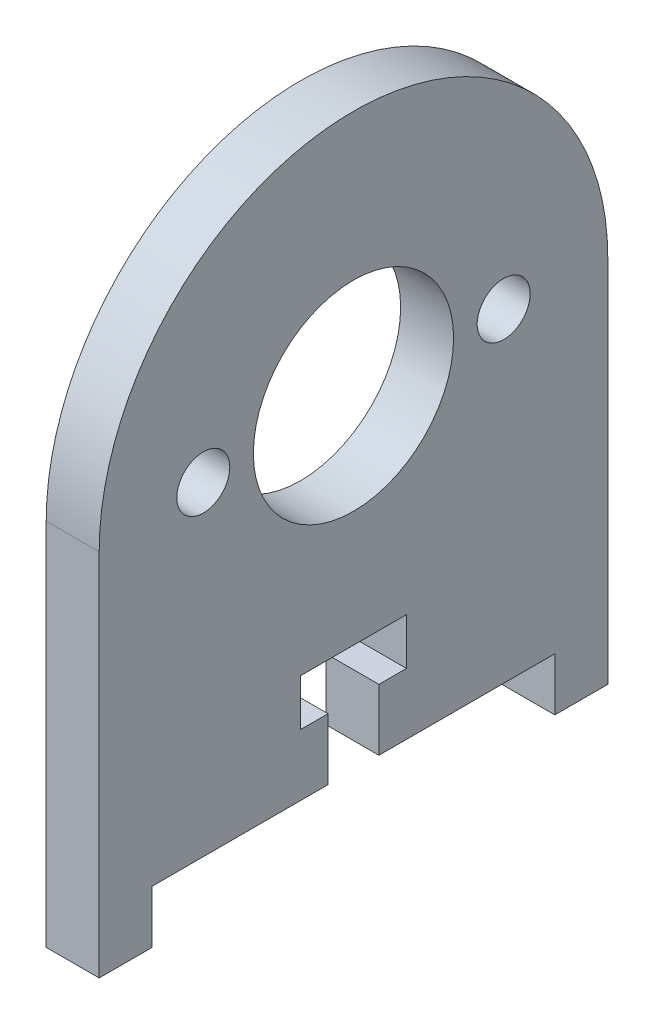
ISO-10303-21;
HEADER;
FILE_DESCRIPTION(('STEP AP214'),'2;1');
FILE_NAME('part.step','',(''),(''),'','','');
FILE_SCHEMA(('AUTOMOTIVE_DESIGN { 1 0 10303 214 1 1 1 1 }'));
ENDSEC;
DATA;
#1=APPLICATION_CONTEXT('core data for automotive mechanical design processes');
#2=APPLICATION_PROTOCOL_DEFINITION('international standard','automotive_design',2000,#1);
#3=PRODUCT_CONTEXT('',#1,'mechanical');
#4=PRODUCT('Part','Part','',(#3));
#5=PRODUCT_RELATED_PRODUCT_CATEGORY('part','',(#4));
#6=PRODUCT_DEFINITION_FORMATION('','',#4);
#7=PRODUCT_DEFINITION_CONTEXT('part definition',#1,'design');
#8=PRODUCT_DEFINITION('design','',#6,#7);
#9=PRODUCT_DEFINITION_SHAPE('','',#8);
#10=(LENGTH_UNIT() NAMED_UNIT(*) SI_UNIT(.MILLI.,.METRE.));
#11=(NAMED_UNIT(*) PLANE_ANGLE_UNIT() SI_UNIT($,.RADIAN.));
#12=(NAMED_UNIT(*) SI_UNIT($,.STERADIAN.) SOLID_ANGLE_UNIT());
#13=UNCERTAINTY_MEASURE_WITH_UNIT(LENGTH_MEASURE(1.E-05),#10,'distance_accuracy_value','');
#14=(GEOMETRIC_REPRESENTATION_CONTEXT(3) GLOBAL_UNCERTAINTY_ASSIGNED_CONTEXT((#13)) GLOBAL_UNIT_ASSIGNED_CONTEXT((#10,
#11,#12)) REPRESENTATION_CONTEXT('',''));
#15=CARTESIAN_POINT('',(0.,0.,0.));
#16=DIRECTION('',(0.,0.,1.));
#17=DIRECTION('',(1.,0.,0.));
#18=AXIS2_PLACEMENT_3D('',#15,#16,#17);
#19=CARTESIAN_POINT('',(3.175,18.9488279396182,-1.524));
#20=DIRECTION('',(-1.,0.,0.));
#21=DIRECTION('',(0.,0.,1.));
#22=AXIS2_PLACEMENT_3D('',#19,#20,#21);
#23=PLANE('',#22);
#24=CARTESIAN_POINT('',(3.175,19.4239572594626,-1.524));
#25=DIRECTION('',(1.,0.,0.));
#26=DIRECTION('',(0.,0.,-1.));
#27=AXIS2_PLACEMENT_3D('',#24,#25,#26);
#28=CIRCLE('',#27,6.);
#29=CARTESIAN_POINT('',(3.175,19.4239572594626,-7.524));
#30=VERTEX_POINT('',#29);
#31=EDGE_CURVE('E339',#30,#30,#28,.T.);
#32=ORIENTED_EDGE('',*,*,#31,.F.);
#33=EDGE_LOOP('',(#32));
#34=FACE_BOUND('',#33,.T.);
#35=DIRECTION('',(0.,0.,-1.));
#36=VECTOR('',#35,1.);
#37=CARTESIAN_POINT('',(3.175,-3.175,10.541));
#38=LINE('',#37,#36);
#39=CARTESIAN_POINT('',(3.175,-3.175,13.716));
#40=VERTEX_POINT('',#39);
#41=CARTESIAN_POINT('',(3.175,-3.175,10.541));
#42=VERTEX_POINT('',#41);
#43=EDGE_CURVE('E209',#40,#42,#38,.T.);
#44=ORIENTED_EDGE('',*,*,#43,.T.);
#45=DIRECTION('',(0.,1.,0.));
#46=VECTOR('',#45,1.);
#47=CARTESIAN_POINT('',(3.175,0.,10.541));
#48=LINE('',#47,#46);
#49=CARTESIAN_POINT('',(3.175,0.,10.541));
#50=VERTEX_POINT('',#49);
#51=EDGE_CURVE('E117',#42,#50,#48,.T.);
#52=ORIENTED_EDGE('',*,*,#51,.T.);
#53=DIRECTION('',(0.,0.,-1.));
#54=VECTOR('',#53,1.);
#55=CARTESIAN_POINT('',(3.175,0.,0.));
#56=LINE('',#55,#54);
#57=CARTESIAN_POINT('',(3.175,0.,0.));
#58=VERTEX_POINT('',#57);
#59=EDGE_CURVE('E248',#50,#58,#56,.T.);
#60=ORIENTED_EDGE('',*,*,#59,.T.);
#61=DIRECTION('',(0.,1.,0.));
#62=VECTOR('',#61,1.);
#63=CARTESIAN_POINT('',(3.175,3.683,0.));
#64=LINE('',#63,#62);
#65=CARTESIAN_POINT('',(3.175,3.683,0.));
#66=VERTEX_POINT('',#65);
#67=EDGE_CURVE('E267',#58,#66,#64,.T.);
#68=ORIENTED_EDGE('',*,*,#67,.T.);
#69=DIRECTION('',(0.,0.,1.));
#70=VECTOR('',#69,1.);
#71=CARTESIAN_POINT('',(3.175,3.683,1.651));
#72=LINE('',#71,#70);
#73=CARTESIAN_POINT('',(3.175,3.683,1.651));
#74=VERTEX_POINT('',#73);
#75=EDGE_CURVE('E264',#66,#74,#72,.T.);
#76=ORIENTED_EDGE('',*,*,#75,.T.);
#77=DIRECTION('',(0.,1.,0.));
#78=VECTOR('',#77,1.);
#79=CARTESIAN_POINT('',(3.175,6.477,1.651));
#80=LINE('',#79,#78);
#81=CARTESIAN_POINT('',(3.175,6.477,1.651));
#82=VERTEX_POINT('',#81);
#83=EDGE_CURVE('E266',#74,#82,#80,.T.);
#84=ORIENTED_EDGE('',*,*,#83,.T.);
#85=DIRECTION('',(0.,0.,-1.));
#86=VECTOR('',#85,1.);
#87=CARTESIAN_POINT('',(3.175,6.477,-4.699));
#88=LINE('',#87,#86);
#89=CARTESIAN_POINT('',(3.175,6.477,-4.699));
#90=VERTEX_POINT('',#89);
#91=EDGE_CURVE('E269',#82,#90,#88,.T.);
#92=ORIENTED_EDGE('',*,*,#91,.T.);
#93=DIRECTION('',(0.,-1.,0.));
#94=VECTOR('',#93,1.);
#95=CARTESIAN_POINT('',(3.175,3.683,-4.699));
#96=LINE('',#95,#94);
#97=CARTESIAN_POINT('',(3.175,3.683,-4.699));
#98=VERTEX_POINT('',#97);
#99=EDGE_CURVE('E275',#90,#98,#96,.T.);
#100=ORIENTED_EDGE('',*,*,#99,.T.);
#101=DIRECTION('',(0.,0.,1.));
#102=VECTOR('',#101,1.);
#103=CARTESIAN_POINT('',(3.175,3.683,-3.048));
#104=LINE('',#103,#102);
#105=CARTESIAN_POINT('',(3.175,3.683,-3.048));
#106=VERTEX_POINT('',#105);
#107=EDGE_CURVE('E277',#98,#106,#104,.T.);
#108=ORIENTED_EDGE('',*,*,#107,.T.);
#109=DIRECTION('',(0.,-1.,0.));
#110=VECTOR('',#109,1.);
#111=CARTESIAN_POINT('',(3.175,0.,-3.048));
#112=LINE('',#111,#110);
#113=CARTESIAN_POINT('',(3.175,0.,-3.048));
#114=VERTEX_POINT('',#113);
#115=EDGE_CURVE('E279',#106,#114,#112,.T.);
#116=ORIENTED_EDGE('',*,*,#115,.T.);
#117=DIRECTION('',(0.,0.,-1.));
#118=VECTOR('',#117,1.);
#119=CARTESIAN_POINT('',(3.175,0.,-13.589));
#120=LINE('',#119,#118);
#121=CARTESIAN_POINT('',(3.175,0.,-13.589));
#122=VERTEX_POINT('',#121);
#123=EDGE_CURVE('E281',#114,#122,#120,.T.);
#124=ORIENTED_EDGE('',*,*,#123,.T.);
#125=DIRECTION('',(0.,-1.,0.));
#126=VECTOR('',#125,1.);
#127=CARTESIAN_POINT('',(3.175,-3.175,-13.589));
#128=LINE('',#127,#126);
#129=CARTESIAN_POINT('',(3.175,-3.175,-13.589));
#130=VERTEX_POINT('',#129);
#131=EDGE_CURVE('E283',#122,#130,#128,.T.);
#132=ORIENTED_EDGE('',*,*,#131,.T.);
#133=DIRECTION('',(0.,0.,-1.));
#134=VECTOR('',#133,1.);
#135=CARTESIAN_POINT('',(3.175,-3.175,-16.764));
#136=LINE('',#135,#134);
#137=CARTESIAN_POINT('',(3.175,-3.175,-16.764));
#138=VERTEX_POINT('',#137);
#139=EDGE_CURVE('E160',#130,#138,#136,.T.);
#140=ORIENTED_EDGE('',*,*,#139,.T.);
#141=DIRECTION('',(0.,1.,0.));
#142=VECTOR('',#141,1.);
#143=CARTESIAN_POINT('',(3.175,18.9488279396182,-16.764));
#144=LINE('',#143,#142);
#145=CARTESIAN_POINT('',(3.175,18.9488279396182,-16.764));
#146=VERTEX_POINT('',#145);
#147=EDGE_CURVE('E154',#138,#146,#144,.T.);
#148=ORIENTED_EDGE('',*,*,#147,.T.);
#149=CARTESIAN_POINT('',(3.175,18.9488279396182,-1.524));
#150=DIRECTION('',(1.,0.,0.));
#151=DIRECTION('',(0.,0.,1.));
#152=AXIS2_PLACEMENT_3D('',#149,#150,#151);
#153=CIRCLE('',#152,15.24);
#154=CARTESIAN_POINT('',(3.175,18.9488279396182,13.716));
#155=VERTEX_POINT('',#154);
#156=EDGE_CURVE('E158',#146,#155,#153,.T.);
#157=ORIENTED_EDGE('',*,*,#156,.T.);
#158=DIRECTION('',(0.,-1.,0.));
#159=VECTOR('',#158,1.);
#160=CARTESIAN_POINT('',(3.175,-3.175,13.716));
#161=LINE('',#160,#159);
#162=EDGE_CURVE('E50',#155,#40,#161,.T.);
#163=ORIENTED_EDGE('',*,*,#162,.T.);
#164=EDGE_LOOP('',(#44,#52,#60,#68,#76,#84,#92,#100,#108,#116,#124,#132,#140,#148,#157,#163));
#165=FACE_BOUND('',#164,.T.);
#166=CARTESIAN_POINT('',(3.175,19.4239572594626,7.476));
#167=DIRECTION('',(1.,0.,0.));
#168=DIRECTION('',(0.,0.,-1.));
#169=AXIS2_PLACEMENT_3D('',#166,#167,#168);
#170=CIRCLE('',#169,1.5875);
#171=CARTESIAN_POINT('',(3.175,19.4239572594626,5.8885));
#172=VERTEX_POINT('',#171);
#173=EDGE_CURVE('E182',#172,#172,#170,.T.);
#174=ORIENTED_EDGE('',*,*,#173,.F.);
#175=EDGE_LOOP('',(#174));
#176=FACE_BOUND('',#175,.T.);
#177=CARTESIAN_POINT('',(3.175,19.4239572594626,-10.524));
#178=DIRECTION('',(1.,0.,0.));
#179=DIRECTION('',(0.,0.,-1.));
#180=AXIS2_PLACEMENT_3D('',#177,#178,#179);
#181=CIRCLE('',#180,1.5875);
#182=CARTESIAN_POINT('',(3.175,19.4239572594626,-12.1115));
#183=VERTEX_POINT('',#182);
#184=EDGE_CURVE('E330',#183,#183,#181,.T.);
#185=ORIENTED_EDGE('',*,*,#184,.F.);
#186=EDGE_LOOP('',(#185));
#187=FACE_BOUND('',#186,.T.);
#188=ADVANCED_FACE('F33',(#34,#165,#176,#187),#23,.F.);
#189=CARTESIAN_POINT('',(0.,18.9488279396182,-1.524));
#190=DIRECTION('',(-1.,0.,0.));
#191=DIRECTION('',(0.,0.,1.));
#192=AXIS2_PLACEMENT_3D('',#189,#190,#191);
#193=PLANE('',#192);
#194=CARTESIAN_POINT('',(0.,19.4239572594626,-1.524));
#195=DIRECTION('',(1.,0.,0.));
#196=DIRECTION('',(0.,0.,-1.));
#197=AXIS2_PLACEMENT_3D('',#194,#195,#196);
#198=CIRCLE('',#197,6.);
#199=CARTESIAN_POINT('',(0.,19.4239572594626,-7.524));
#200=VERTEX_POINT('',#199);
#201=EDGE_CURVE('E336',#200,#200,#198,.T.);
#202=ORIENTED_EDGE('',*,*,#201,.T.);
#203=EDGE_LOOP('',(#202));
#204=FACE_BOUND('',#203,.T.);
#205=DIRECTION('',(0.,0.,-1.));
#206=VECTOR('',#205,1.);
#207=CARTESIAN_POINT('',(0.,-3.175,10.541));
#208=LINE('',#207,#206);
#209=CARTESIAN_POINT('',(0.,-3.175,13.716));
#210=VERTEX_POINT('',#209);
#211=CARTESIAN_POINT('',(0.,-3.175,10.541));
#212=VERTEX_POINT('',#211);
#213=EDGE_CURVE('E178',#210,#212,#208,.T.);
#214=ORIENTED_EDGE('',*,*,#213,.F.);
#215=DIRECTION('',(0.,-1.,0.));
#216=VECTOR('',#215,1.);
#217=CARTESIAN_POINT('',(0.,-3.175,13.716));
#218=LINE('',#217,#216);
#219=CARTESIAN_POINT('',(0.,18.9488279396182,13.716));
#220=VERTEX_POINT('',#219);
#221=EDGE_CURVE('E109',#220,#210,#218,.T.);
#222=ORIENTED_EDGE('',*,*,#221,.F.);
#223=CARTESIAN_POINT('',(0.,18.9488279396182,-1.524));
#224=DIRECTION('',(1.,0.,0.));
#225=DIRECTION('',(0.,0.,1.));
#226=AXIS2_PLACEMENT_3D('',#223,#224,#225);
#227=CIRCLE('',#226,15.24);
#228=CARTESIAN_POINT('',(0.,18.9488279396182,-16.764));
#229=VERTEX_POINT('',#228);
#230=EDGE_CURVE('E103',#229,#220,#227,.T.);
#231=ORIENTED_EDGE('',*,*,#230,.F.);
#232=DIRECTION('',(0.,1.,0.));
#233=VECTOR('',#232,1.);
#234=CARTESIAN_POINT('',(0.,18.9488279396182,-16.764));
#235=LINE('',#234,#233);
#236=CARTESIAN_POINT('',(0.,-3.175,-16.764));
#237=VERTEX_POINT('',#236);
#238=EDGE_CURVE('E168',#237,#229,#235,.T.);
#239=ORIENTED_EDGE('',*,*,#238,.F.);
#240=DIRECTION('',(0.,0.,-1.));
#241=VECTOR('',#240,1.);
#242=CARTESIAN_POINT('',(0.,-3.175,-16.764));
#243=LINE('',#242,#241);
#244=CARTESIAN_POINT('',(0.,-3.175,-13.589));
#245=VERTEX_POINT('',#244);
#246=EDGE_CURVE('E204',#245,#237,#243,.T.);
#247=ORIENTED_EDGE('',*,*,#246,.F.);
#248=DIRECTION('',(0.,-1.,0.));
#249=VECTOR('',#248,1.);
#250=CARTESIAN_POINT('',(0.,-3.175,-13.589));
#251=LINE('',#250,#249);
#252=CARTESIAN_POINT('',(0.,0.,-13.589));
#253=VERTEX_POINT('',#252);
#254=EDGE_CURVE('E202',#253,#245,#251,.T.);
#255=ORIENTED_EDGE('',*,*,#254,.F.);
#256=DIRECTION('',(0.,0.,-1.));
#257=VECTOR('',#256,1.);
#258=CARTESIAN_POINT('',(0.,0.,-13.589));
#259=LINE('',#258,#257);
#260=CARTESIAN_POINT('',(0.,0.,-3.048));
#261=VERTEX_POINT('',#260);
#262=EDGE_CURVE('E200',#261,#253,#259,.T.);
#263=ORIENTED_EDGE('',*,*,#262,.F.);
#264=DIRECTION('',(0.,-1.,0.));
#265=VECTOR('',#264,1.);
#266=CARTESIAN_POINT('',(0.,0.,-3.048));
#267=LINE('',#266,#265);
#268=CARTESIAN_POINT('',(0.,3.683,-3.048));
#269=VERTEX_POINT('',#268);
#270=EDGE_CURVE('E198',#269,#261,#267,.T.);
#271=ORIENTED_EDGE('',*,*,#270,.F.);
#272=DIRECTION('',(0.,0.,1.));
#273=VECTOR('',#272,1.);
#274=CARTESIAN_POINT('',(0.,3.683,-3.048));
#275=LINE('',#274,#273);
#276=CARTESIAN_POINT('',(0.,3.683,-4.699));
#277=VERTEX_POINT('',#276);
#278=EDGE_CURVE('E196',#277,#269,#275,.T.);
#279=ORIENTED_EDGE('',*,*,#278,.F.);
#280=DIRECTION('',(0.,-1.,0.));
#281=VECTOR('',#280,1.);
#282=CARTESIAN_POINT('',(0.,3.683,-4.699));
#283=LINE('',#282,#281);
#284=CARTESIAN_POINT('',(0.,6.477,-4.699));
#285=VERTEX_POINT('',#284);
#286=EDGE_CURVE('E194',#285,#277,#283,.T.);
#287=ORIENTED_EDGE('',*,*,#286,.F.);
#288=DIRECTION('',(0.,0.,-1.));
#289=VECTOR('',#288,1.);
#290=CARTESIAN_POINT('',(0.,6.477,-4.699));
#291=LINE('',#290,#289);
#292=CARTESIAN_POINT('',(0.,6.477,1.651));
#293=VERTEX_POINT('',#292);
#294=EDGE_CURVE('E192',#293,#285,#291,.T.);
#295=ORIENTED_EDGE('',*,*,#294,.F.);
#296=DIRECTION('',(0.,1.,0.));
#297=VECTOR('',#296,1.);
#298=CARTESIAN_POINT('',(0.,6.477,1.651));
#299=LINE('',#298,#297);
#300=CARTESIAN_POINT('',(0.,3.683,1.651));
#301=VERTEX_POINT('',#300);
#302=EDGE_CURVE('E190',#301,#293,#299,.T.);
#303=ORIENTED_EDGE('',*,*,#302,.F.);
#304=DIRECTION('',(0.,0.,1.));
#305=VECTOR('',#304,1.);
#306=CARTESIAN_POINT('',(0.,3.683,1.651));
#307=LINE('',#306,#305);
#308=CARTESIAN_POINT('',(0.,3.683,0.));
#309=VERTEX_POINT('',#308);
#310=EDGE_CURVE('E188',#309,#301,#307,.T.);
#311=ORIENTED_EDGE('',*,*,#310,.F.);
#312=DIRECTION('',(0.,1.,0.));
#313=VECTOR('',#312,1.);
#314=CARTESIAN_POINT('',(0.,3.683,0.));
#315=LINE('',#314,#313);
#316=CARTESIAN_POINT('',(0.,0.,0.));
#317=VERTEX_POINT('',#316);
#318=EDGE_CURVE('E186',#317,#309,#315,.T.);
#319=ORIENTED_EDGE('',*,*,#318,.F.);
#320=DIRECTION('',(0.,0.,-1.));
#321=VECTOR('',#320,1.);
#322=CARTESIAN_POINT('',(0.,0.,0.));
#323=LINE('',#322,#321);
#324=CARTESIAN_POINT('',(0.,0.,10.541));
#325=VERTEX_POINT('',#324);
#326=EDGE_CURVE('E184',#325,#317,#323,.T.);
#327=ORIENTED_EDGE('',*,*,#326,.F.);
#328=DIRECTION('',(0.,1.,0.));
#329=VECTOR('',#328,1.);
#330=CARTESIAN_POINT('',(0.,0.,10.541));
#331=LINE('',#330,#329);
#332=EDGE_CURVE('E181',#212,#325,#331,.T.);
#333=ORIENTED_EDGE('',*,*,#332,.F.);
#334=EDGE_LOOP('',(#214,#222,#231,#239,#247,#255,#263,#271,#279,#287,#295,#303,#311,#319,#327,#333));
#335=FACE_BOUND('',#334,.T.);
#336=CARTESIAN_POINT('',(0.,19.4239572594626,7.476));
#337=DIRECTION('',(1.,0.,0.));
#338=DIRECTION('',(0.,0.,-1.));
#339=AXIS2_PLACEMENT_3D('',#336,#337,#338);
#340=CIRCLE('',#339,1.5875);
#341=CARTESIAN_POINT('',(0.,19.4239572594626,5.8885));
#342=VERTEX_POINT('',#341);
#343=EDGE_CURVE('E342',#342,#342,#340,.T.);
#344=ORIENTED_EDGE('',*,*,#343,.T.);
#345=EDGE_LOOP('',(#344));
#346=FACE_BOUND('',#345,.T.);
#347=CARTESIAN_POINT('',(0.,19.4239572594626,-10.524));
#348=DIRECTION('',(1.,0.,0.));
#349=DIRECTION('',(0.,0.,-1.));
#350=AXIS2_PLACEMENT_3D('',#347,#348,#349);
#351=CIRCLE('',#350,1.5875);
#352=CARTESIAN_POINT('',(0.,19.4239572594626,-12.1115));
#353=VERTEX_POINT('',#352);
#354=EDGE_CURVE('E333',#353,#353,#351,.T.);
#355=ORIENTED_EDGE('',*,*,#354,.T.);
#356=EDGE_LOOP('',(#355));
#357=FACE_BOUND('',#356,.T.);
#358=ADVANCED_FACE('F252',(#204,#335,#346,#357),#193,.T.);
#359=CARTESIAN_POINT('',(3.175,-3.175,10.541));
#360=DIRECTION('',(0.,1.,0.));
#361=DIRECTION('',(0.,0.,1.));
#362=AXIS2_PLACEMENT_3D('',#359,#360,#361);
#363=PLANE('',#362);
#364=ORIENTED_EDGE('',*,*,#213,.T.);
#365=DIRECTION('',(-1.,0.,0.));
#366=VECTOR('',#365,1.);
#367=CARTESIAN_POINT('',(3.175,-3.175,10.541));
#368=LINE('',#367,#366);
#369=EDGE_CURVE('E11',#42,#212,#368,.T.);
#370=ORIENTED_EDGE('',*,*,#369,.F.);
#371=ORIENTED_EDGE('',*,*,#43,.F.);
#372=DIRECTION('',(-1.,0.,0.));
#373=VECTOR('',#372,1.);
#374=CARTESIAN_POINT('',(3.175,-3.175,13.716));
#375=LINE('',#374,#373);
#376=EDGE_CURVE('E174',#40,#210,#375,.T.);
#377=ORIENTED_EDGE('',*,*,#376,.T.);
#378=EDGE_LOOP('',(#364,#370,#371,#377));
#379=FACE_BOUND('',#378,.T.);
#380=ADVANCED_FACE('F35',(#379),#363,.F.);
#381=CARTESIAN_POINT('',(3.175,0.,10.541));
#382=DIRECTION('',(0.,0.,1.));
#383=DIRECTION('',(1.,0.,0.));
#384=AXIS2_PLACEMENT_3D('',#381,#382,#383);
#385=PLANE('',#384);
#386=ORIENTED_EDGE('',*,*,#332,.T.);
#387=DIRECTION('',(-1.,0.,0.));
#388=VECTOR('',#387,1.);
#389=CARTESIAN_POINT('',(3.175,0.,10.541));
#390=LINE('',#389,#388);
#391=EDGE_CURVE('E42',#50,#325,#390,.T.);
#392=ORIENTED_EDGE('',*,*,#391,.F.);
#393=ORIENTED_EDGE('',*,*,#51,.F.);
#394=ORIENTED_EDGE('',*,*,#369,.T.);
#395=EDGE_LOOP('',(#386,#392,#393,#394));
#396=FACE_BOUND('',#395,.T.);
#397=ADVANCED_FACE('F483',(#396),#385,.F.);
#398=CARTESIAN_POINT('',(3.175,0.,0.));
#399=DIRECTION('',(0.,1.,0.));
#400=DIRECTION('',(0.,0.,1.));
#401=AXIS2_PLACEMENT_3D('',#398,#399,#400);
#402=PLANE('',#401);
#403=ORIENTED_EDGE('',*,*,#326,.T.);
#404=DIRECTION('',(-1.,0.,0.));
#405=VECTOR('',#404,1.);
#406=CARTESIAN_POINT('',(3.175,0.,0.));
#407=LINE('',#406,#405);
#408=EDGE_CURVE('E240',#58,#317,#407,.T.);
#409=ORIENTED_EDGE('',*,*,#408,.F.);
#410=ORIENTED_EDGE('',*,*,#59,.F.);
#411=ORIENTED_EDGE('',*,*,#391,.T.);
#412=EDGE_LOOP('',(#403,#409,#410,#411));
#413=FACE_BOUND('',#412,.T.);
#414=ADVANCED_FACE('F246',(#413),#402,.F.);
#415=CARTESIAN_POINT('',(3.175,3.683,0.));
#416=DIRECTION('',(0.,0.,1.));
#417=DIRECTION('',(1.,0.,0.));
#418=AXIS2_PLACEMENT_3D('',#415,#416,#417);
#419=PLANE('',#418);
#420=ORIENTED_EDGE('',*,*,#318,.T.);
#421=DIRECTION('',(-1.,0.,0.));
#422=VECTOR('',#421,1.);
#423=CARTESIAN_POINT('',(3.175,3.683,0.));
#424=LINE('',#423,#422);
#425=EDGE_CURVE('E237',#66,#309,#424,.T.);
#426=ORIENTED_EDGE('',*,*,#425,.F.);
#427=ORIENTED_EDGE('',*,*,#67,.F.);
#428=ORIENTED_EDGE('',*,*,#408,.T.);
#429=EDGE_LOOP('',(#420,#426,#427,#428));
#430=FACE_BOUND('',#429,.T.);
#431=ADVANCED_FACE('F258',(#430),#419,.F.);
#432=CARTESIAN_POINT('',(3.175,3.683,1.651));
#433=DIRECTION('',(0.,-1.,0.));
#434=DIRECTION('',(0.,0.,-1.));
#435=AXIS2_PLACEMENT_3D('',#432,#433,#434);
#436=PLANE('',#435);
#437=ORIENTED_EDGE('',*,*,#310,.T.);
#438=DIRECTION('',(-1.,0.,0.));
#439=VECTOR('',#438,1.);
#440=CARTESIAN_POINT('',(3.175,3.683,1.651));
#441=LINE('',#440,#439);
#442=EDGE_CURVE('E234',#74,#301,#441,.T.);
#443=ORIENTED_EDGE('',*,*,#442,.F.);
#444=ORIENTED_EDGE('',*,*,#75,.F.);
#445=ORIENTED_EDGE('',*,*,#425,.T.);
#446=EDGE_LOOP('',(#437,#443,#444,#445));
#447=FACE_BOUND('',#446,.T.);
#448=ADVANCED_FACE('F262',(#447),#436,.F.);
#449=CARTESIAN_POINT('',(3.175,6.477,1.651));
#450=DIRECTION('',(0.,0.,1.));
#451=DIRECTION('',(0.,-1.,0.));
#452=AXIS2_PLACEMENT_3D('',#449,#450,#451);
#453=PLANE('',#452);
#454=ORIENTED_EDGE('',*,*,#302,.T.);
#455=DIRECTION('',(-1.,0.,0.));
#456=VECTOR('',#455,1.);
#457=CARTESIAN_POINT('',(3.175,6.477,1.651));
#458=LINE('',#457,#456);
#459=EDGE_CURVE('E231',#82,#293,#458,.T.);
#460=ORIENTED_EDGE('',*,*,#459,.F.);
#461=ORIENTED_EDGE('',*,*,#83,.F.);
#462=ORIENTED_EDGE('',*,*,#442,.T.);
#463=EDGE_LOOP('',(#454,#460,#461,#462));
#464=FACE_BOUND('',#463,.T.);
#465=ADVANCED_FACE('F448',(#464),#453,.F.);
#466=CARTESIAN_POINT('',(3.175,6.477,-4.699));
#467=DIRECTION('',(0.,1.,0.));
#468=DIRECTION('',(0.,0.,1.));
#469=AXIS2_PLACEMENT_3D('',#466,#467,#468);
#470=PLANE('',#469);
#471=ORIENTED_EDGE('',*,*,#294,.T.);
#472=DIRECTION('',(-1.,0.,0.));
#473=VECTOR('',#472,1.);
#474=CARTESIAN_POINT('',(3.175,6.477,-4.699));
#475=LINE('',#474,#473);
#476=EDGE_CURVE('E228',#90,#285,#475,.T.);
#477=ORIENTED_EDGE('',*,*,#476,.F.);
#478=ORIENTED_EDGE('',*,*,#91,.F.);
#479=ORIENTED_EDGE('',*,*,#459,.T.);
#480=EDGE_LOOP('',(#471,#477,#478,#479));
#481=FACE_BOUND('',#480,.T.);
#482=ADVANCED_FACE('F438',(#481),#470,.F.);
#483=CARTESIAN_POINT('',(3.175,3.683,-4.699));
#484=DIRECTION('',(0.,0.,-1.));
#485=DIRECTION('',(-1.,0.,0.));
#486=AXIS2_PLACEMENT_3D('',#483,#484,#485);
#487=PLANE('',#486);
#488=ORIENTED_EDGE('',*,*,#286,.T.);
#489=DIRECTION('',(-1.,0.,0.));
#490=VECTOR('',#489,1.);
#491=CARTESIAN_POINT('',(3.175,3.683,-4.699));
#492=LINE('',#491,#490);
#493=EDGE_CURVE('E225',#98,#277,#492,.T.);
#494=ORIENTED_EDGE('',*,*,#493,.F.);
#495=ORIENTED_EDGE('',*,*,#99,.F.);
#496=ORIENTED_EDGE('',*,*,#476,.T.);
#497=EDGE_LOOP('',(#488,#494,#495,#496));
#498=FACE_BOUND('',#497,.T.);
#499=ADVANCED_FACE('F428',(#498),#487,.F.);
#500=CARTESIAN_POINT('',(3.175,3.683,-3.048));
#501=DIRECTION('',(0.,-1.,0.));
#502=DIRECTION('',(0.,0.,-1.));
#503=AXIS2_PLACEMENT_3D('',#500,#501,#502);
#504=PLANE('',#503);
#505=ORIENTED_EDGE('',*,*,#278,.T.);
#506=DIRECTION('',(-1.,0.,0.));
#507=VECTOR('',#506,1.);
#508=CARTESIAN_POINT('',(3.175,3.683,-3.048));
#509=LINE('',#508,#507);
#510=EDGE_CURVE('E222',#106,#269,#509,.T.);
#511=ORIENTED_EDGE('',*,*,#510,.F.);
#512=ORIENTED_EDGE('',*,*,#107,.F.);
#513=ORIENTED_EDGE('',*,*,#493,.T.);
#514=EDGE_LOOP('',(#505,#511,#512,#513));
#515=FACE_BOUND('',#514,.T.);
#516=ADVANCED_FACE('F418',(#515),#504,.F.);
#517=CARTESIAN_POINT('',(3.175,0.,-3.048));
#518=DIRECTION('',(0.,0.,-1.));
#519=DIRECTION('',(0.,1.,0.));
#520=AXIS2_PLACEMENT_3D('',#517,#518,#519);
#521=PLANE('',#520);
#522=ORIENTED_EDGE('',*,*,#270,.T.);
#523=DIRECTION('',(-1.,0.,0.));
#524=VECTOR('',#523,1.);
#525=CARTESIAN_POINT('',(3.175,0.,-3.048));
#526=LINE('',#525,#524);
#527=EDGE_CURVE('E219',#114,#261,#526,.T.);
#528=ORIENTED_EDGE('',*,*,#527,.F.);
#529=ORIENTED_EDGE('',*,*,#115,.F.);
#530=ORIENTED_EDGE('',*,*,#510,.T.);
#531=EDGE_LOOP('',(#522,#528,#529,#530));
#532=FACE_BOUND('',#531,.T.);
#533=ADVANCED_FACE('F408',(#532),#521,.F.);
#534=CARTESIAN_POINT('',(3.175,0.,-13.589));
#535=DIRECTION('',(0.,1.,0.));
#536=DIRECTION('',(0.,0.,1.));
#537=AXIS2_PLACEMENT_3D('',#534,#535,#536);
#538=PLANE('',#537);
#539=ORIENTED_EDGE('',*,*,#262,.T.);
#540=DIRECTION('',(-1.,0.,0.));
#541=VECTOR('',#540,1.);
#542=CARTESIAN_POINT('',(3.175,0.,-13.589));
#543=LINE('',#542,#541);
#544=EDGE_CURVE('E216',#122,#253,#543,.T.);
#545=ORIENTED_EDGE('',*,*,#544,.F.);
#546=ORIENTED_EDGE('',*,*,#123,.F.);
#547=ORIENTED_EDGE('',*,*,#527,.T.);
#548=EDGE_LOOP('',(#539,#545,#546,#547));
#549=FACE_BOUND('',#548,.T.);
#550=ADVANCED_FACE('F399',(#549),#538,.F.);
#551=CARTESIAN_POINT('',(3.175,-3.175,-13.589));
#552=DIRECTION('',(0.,0.,-1.));
#553=DIRECTION('',(-1.,0.,0.));
#554=AXIS2_PLACEMENT_3D('',#551,#552,#553);
#555=PLANE('',#554);
#556=ORIENTED_EDGE('',*,*,#254,.T.);
#557=DIRECTION('',(-1.,0.,0.));
#558=VECTOR('',#557,1.);
#559=CARTESIAN_POINT('',(3.175,-3.175,-13.589));
#560=LINE('',#559,#558);
#561=EDGE_CURVE('E213',#130,#245,#560,.T.);
#562=ORIENTED_EDGE('',*,*,#561,.F.);
#563=ORIENTED_EDGE('',*,*,#131,.F.);
#564=ORIENTED_EDGE('',*,*,#544,.T.);
#565=EDGE_LOOP('',(#556,#562,#563,#564));
#566=FACE_BOUND('',#565,.T.);
#567=ADVANCED_FACE('F289',(#566),#555,.F.);
#568=CARTESIAN_POINT('',(3.175,-3.175,-16.764));
#569=DIRECTION('',(0.,1.,0.));
#570=DIRECTION('',(0.,0.,1.));
#571=AXIS2_PLACEMENT_3D('',#568,#569,#570);
#572=PLANE('',#571);
#573=ORIENTED_EDGE('',*,*,#246,.T.);
#574=DIRECTION('',(-1.,0.,0.));
#575=VECTOR('',#574,1.);
#576=CARTESIAN_POINT('',(3.175,-3.175,-16.764));
#577=LINE('',#576,#575);
#578=EDGE_CURVE('E169',#138,#237,#577,.T.);
#579=ORIENTED_EDGE('',*,*,#578,.F.);
#580=ORIENTED_EDGE('',*,*,#139,.F.);
#581=ORIENTED_EDGE('',*,*,#561,.T.);
#582=EDGE_LOOP('',(#573,#579,#580,#581));
#583=FACE_BOUND('',#582,.T.);
#584=ADVANCED_FACE('F293',(#583),#572,.F.);
#585=CARTESIAN_POINT('',(3.175,18.9488279396182,-16.764));
#586=DIRECTION('',(0.,0.,1.));
#587=DIRECTION('',(0.,-1.,0.));
#588=AXIS2_PLACEMENT_3D('',#585,#586,#587);
#589=PLANE('',#588);
#590=ORIENTED_EDGE('',*,*,#238,.T.);
#591=DIRECTION('',(-1.,0.,0.));
#592=VECTOR('',#591,1.);
#593=CARTESIAN_POINT('',(3.175,18.9488279396182,-16.764));
#594=LINE('',#593,#592);
#595=EDGE_CURVE('E165',#146,#229,#594,.T.);
#596=ORIENTED_EDGE('',*,*,#595,.F.);
#597=ORIENTED_EDGE('',*,*,#147,.F.);
#598=ORIENTED_EDGE('',*,*,#578,.T.);
#599=EDGE_LOOP('',(#590,#596,#597,#598));
#600=FACE_BOUND('',#599,.T.);
#601=ADVANCED_FACE('F166',(#600),#589,.F.);
#602=CARTESIAN_POINT('',(3.175,18.9488279396182,-1.524));
#603=DIRECTION('',(-1.,0.,0.));
#604=DIRECTION('',(0.,0.,1.));
#605=AXIS2_PLACEMENT_3D('',#602,#603,#604);
#606=CYLINDRICAL_SURFACE('',#605,15.24);
#607=ORIENTED_EDGE('',*,*,#230,.T.);
#608=DIRECTION('',(-1.,0.,0.));
#609=VECTOR('',#608,1.);
#610=CARTESIAN_POINT('',(3.175,18.9488279396182,13.716));
#611=LINE('',#610,#609);
#612=EDGE_CURVE('E170',#155,#220,#611,.T.);
#613=ORIENTED_EDGE('',*,*,#612,.F.);
#614=ORIENTED_EDGE('',*,*,#156,.F.);
#615=ORIENTED_EDGE('',*,*,#595,.T.);
#616=EDGE_LOOP('',(#607,#613,#614,#615));
#617=FACE_BOUND('',#616,.T.);
#618=ADVANCED_FACE('F172',(#617),#606,.T.);
#619=CARTESIAN_POINT('',(3.175,-3.175,13.716));
#620=DIRECTION('',(0.,0.,-1.));
#621=DIRECTION('',(-1.,0.,0.));
#622=AXIS2_PLACEMENT_3D('',#619,#620,#621);
#623=PLANE('',#622);
#624=ORIENTED_EDGE('',*,*,#221,.T.);
#625=ORIENTED_EDGE('',*,*,#376,.F.);
#626=ORIENTED_EDGE('',*,*,#162,.F.);
#627=ORIENTED_EDGE('',*,*,#612,.T.);
#628=EDGE_LOOP('',(#624,#625,#626,#627));
#629=FACE_BOUND('',#628,.T.);
#630=ADVANCED_FACE('F297',(#629),#623,.F.);
#631=CARTESIAN_POINT('',(3.175,19.4239572594626,7.476));
#632=DIRECTION('',(-1.,0.,0.));
#633=DIRECTION('',(0.,0.,1.));
#634=AXIS2_PLACEMENT_3D('',#631,#632,#633);
#635=CYLINDRICAL_SURFACE('',#634,1.5875);
#636=ORIENTED_EDGE('',*,*,#173,.T.);
#637=EDGE_LOOP('',(#636));
#638=FACE_BOUND('',#637,.T.);
#639=ORIENTED_EDGE('',*,*,#343,.F.);
#640=EDGE_LOOP('',(#639));
#641=FACE_BOUND('',#640,.T.);
#642=ADVANCED_FACE('F299',(#638,#641),#635,.F.);
#643=CARTESIAN_POINT('',(3.175,19.4239572594626,-1.524));
#644=DIRECTION('',(-1.,0.,0.));
#645=DIRECTION('',(0.,0.,1.));
#646=AXIS2_PLACEMENT_3D('',#643,#644,#645);
#647=CYLINDRICAL_SURFACE('',#646,6.);
#648=ORIENTED_EDGE('',*,*,#31,.T.);
#649=EDGE_LOOP('',(#648));
#650=FACE_BOUND('',#649,.T.);
#651=ORIENTED_EDGE('',*,*,#201,.F.);
#652=EDGE_LOOP('',(#651));
#653=FACE_BOUND('',#652,.T.);
#654=ADVANCED_FACE('F305',(#650,#653),#647,.F.);
#655=CARTESIAN_POINT('',(3.175,19.4239572594626,-10.524));
#656=DIRECTION('',(-1.,0.,0.));
#657=DIRECTION('',(0.,0.,1.));
#658=AXIS2_PLACEMENT_3D('',#655,#656,#657);
#659=CYLINDRICAL_SURFACE('',#658,1.5875);
#660=ORIENTED_EDGE('',*,*,#184,.T.);
#661=EDGE_LOOP('',(#660));
#662=FACE_BOUND('',#661,.T.);
#663=ORIENTED_EDGE('',*,*,#354,.F.);
#664=EDGE_LOOP('',(#663));
#665=FACE_BOUND('',#664,.T.);
#666=ADVANCED_FACE('F321',(#662,#665),#659,.F.);
#667=CLOSED_SHELL('',(#188,#358,#380,#397,#414,#431,#448,#465,#482,#499,#516,#533,#550,#567,
#584,#601,#618,#630,#642,#654,#666));
#668=MANIFOLD_SOLID_BREP('B2',#667);
#669=ADVANCED_BREP_SHAPE_REPRESENTATION('',(#18,#668),#14);
#670=SHAPE_DEFINITION_REPRESENTATION(#9,#669);
ENDSEC;
END-ISO-10303-21;
